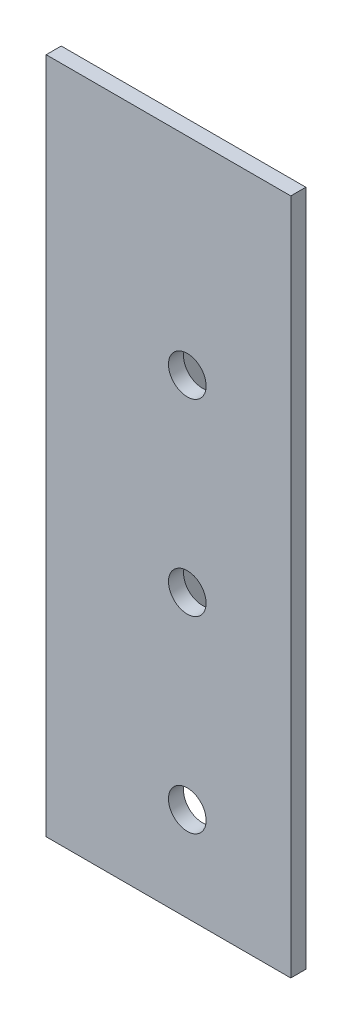
ISO-10303-21;
HEADER;
FILE_DESCRIPTION(('STEP AP214'),'2;1');
FILE_NAME('part.step','',(''),(''),'','','');
FILE_SCHEMA(('AUTOMOTIVE_DESIGN { 1 0 10303 214 1 1 1 1 }'));
ENDSEC;
DATA;
#1=APPLICATION_CONTEXT('core data for automotive mechanical design processes');
#2=APPLICATION_PROTOCOL_DEFINITION('international standard','automotive_design',2000,#1);
#3=PRODUCT_CONTEXT('',#1,'mechanical');
#4=PRODUCT('Part','Part','',(#3));
#5=PRODUCT_RELATED_PRODUCT_CATEGORY('part','',(#4));
#6=PRODUCT_DEFINITION_FORMATION('','',#4);
#7=PRODUCT_DEFINITION_CONTEXT('part definition',#1,'design');
#8=PRODUCT_DEFINITION('design','',#6,#7);
#9=PRODUCT_DEFINITION_SHAPE('','',#8);
#10=(LENGTH_UNIT() NAMED_UNIT(*) SI_UNIT(.MILLI.,.METRE.));
#11=(NAMED_UNIT(*) PLANE_ANGLE_UNIT() SI_UNIT($,.RADIAN.));
#12=(NAMED_UNIT(*) SI_UNIT($,.STERADIAN.) SOLID_ANGLE_UNIT());
#13=UNCERTAINTY_MEASURE_WITH_UNIT(LENGTH_MEASURE(1.E-05),#10,'distance_accuracy_value','');
#14=(GEOMETRIC_REPRESENTATION_CONTEXT(3) GLOBAL_UNCERTAINTY_ASSIGNED_CONTEXT((#13)) GLOBAL_UNIT_ASSIGNED_CONTEXT((#10,
#11,#12)) REPRESENTATION_CONTEXT('',''));
#15=CARTESIAN_POINT('',(0.,0.,0.));
#16=DIRECTION('',(0.,0.,1.));
#17=DIRECTION('',(1.,0.,0.));
#18=AXIS2_PLACEMENT_3D('',#15,#16,#17);
#19=CARTESIAN_POINT('',(4.,180.,0.));
#20=DIRECTION('',(-1.,0.,0.));
#21=DIRECTION('',(0.,0.,1.));
#22=AXIS2_PLACEMENT_3D('',#19,#20,#21);
#23=PLANE('',#22);
#24=DIRECTION('',(0.,-1.,0.));
#25=VECTOR('',#24,1.);
#26=CARTESIAN_POINT('',(4.,180.,-65.));
#27=LINE('',#26,#25);
#28=CARTESIAN_POINT('',(4.,119.,-65.));
#29=VERTEX_POINT('',#28);
#30=CARTESIAN_POINT('',(4.,0.,-65.));
#31=VERTEX_POINT('',#30);
#32=EDGE_CURVE('E41',#29,#31,#27,.T.);
#33=ORIENTED_EDGE('',*,*,#32,.F.);
#34=DIRECTION('',(0.,0.707106781186548,0.707106781186548));
#35=VECTOR('',#34,1.);
#36=CARTESIAN_POINT('',(4.,182.,-2.));
#37=LINE('',#36,#35);
#38=CARTESIAN_POINT('',(4.,180.,-4.));
#39=VERTEX_POINT('',#38);
#40=EDGE_CURVE('E101',#29,#39,#37,.T.);
#41=ORIENTED_EDGE('',*,*,#40,.T.);
#42=DIRECTION('',(0.,-1.,0.));
#43=VECTOR('',#42,1.);
#44=CARTESIAN_POINT('',(4.,180.,-4.));
#45=LINE('',#44,#43);
#46=CARTESIAN_POINT('',(4.,0.,-4.));
#47=VERTEX_POINT('',#46);
#48=EDGE_CURVE('E149',#39,#47,#45,.T.);
#49=ORIENTED_EDGE('',*,*,#48,.T.);
#50=DIRECTION('',(0.,0.,-1.));
#51=VECTOR('',#50,1.);
#52=CARTESIAN_POINT('',(4.,0.,0.));
#53=LINE('',#52,#51);
#54=EDGE_CURVE('E124',#47,#31,#53,.T.);
#55=ORIENTED_EDGE('',*,*,#54,.T.);
#56=EDGE_LOOP('',(#33,#41,#49,#55));
#57=FACE_BOUND('',#56,.T.);
#58=ADVANCED_FACE('F34',(#57),#23,.F.);
#59=CARTESIAN_POINT('',(0.,180.,-65.));
#60=DIRECTION('',(0.,0.,-1.));
#61=DIRECTION('',(-1.,0.,0.));
#62=AXIS2_PLACEMENT_3D('',#59,#60,#61);
#63=PLANE('',#62);
#64=DIRECTION('',(-1.,0.,0.));
#65=VECTOR('',#64,1.);
#66=CARTESIAN_POINT('',(10.,119.,-65.));
#67=LINE('',#66,#65);
#68=CARTESIAN_POINT('',(0.,119.,-65.));
#69=VERTEX_POINT('',#68);
#70=EDGE_CURVE('E98',#29,#69,#67,.T.);
#71=ORIENTED_EDGE('',*,*,#70,.F.);
#72=ORIENTED_EDGE('',*,*,#32,.T.);
#73=DIRECTION('',(1.,0.,0.));
#74=VECTOR('',#73,1.);
#75=CARTESIAN_POINT('',(0.,0.,-65.));
#76=LINE('',#75,#74);
#77=CARTESIAN_POINT('',(0.,0.,-65.));
#78=VERTEX_POINT('',#77);
#79=EDGE_CURVE('E113',#78,#31,#76,.T.);
#80=ORIENTED_EDGE('',*,*,#79,.F.);
#81=DIRECTION('',(0.,-1.,0.));
#82=VECTOR('',#81,1.);
#83=CARTESIAN_POINT('',(0.,180.,-65.));
#84=LINE('',#83,#82);
#85=EDGE_CURVE('E107',#69,#78,#84,.T.);
#86=ORIENTED_EDGE('',*,*,#85,.F.);
#87=EDGE_LOOP('',(#71,#72,#80,#86));
#88=FACE_BOUND('',#87,.T.);
#89=ADVANCED_FACE('F111',(#88),#63,.T.);
#90=CARTESIAN_POINT('',(0.,180.,0.));
#91=DIRECTION('',(-1.,0.,0.));
#92=DIRECTION('',(0.,0.,1.));
#93=AXIS2_PLACEMENT_3D('',#90,#91,#92);
#94=PLANE('',#93);
#95=DIRECTION('',(0.,0.707106781186548,0.707106781186548));
#96=VECTOR('',#95,1.);
#97=CARTESIAN_POINT('',(0.,180.,-4.));
#98=LINE('',#97,#96);
#99=CARTESIAN_POINT('',(0.,180.,-4.));
#100=VERTEX_POINT('',#99);
#101=EDGE_CURVE('E48',#69,#100,#98,.T.);
#102=ORIENTED_EDGE('',*,*,#101,.F.);
#103=ORIENTED_EDGE('',*,*,#85,.T.);
#104=DIRECTION('',(0.,0.,-1.));
#105=VECTOR('',#104,1.);
#106=CARTESIAN_POINT('',(0.,0.,0.));
#107=LINE('',#106,#105);
#108=CARTESIAN_POINT('',(0.,0.,0.));
#109=VERTEX_POINT('',#108);
#110=EDGE_CURVE('E153',#109,#78,#107,.T.);
#111=ORIENTED_EDGE('',*,*,#110,.F.);
#112=DIRECTION('',(0.,-1.,0.));
#113=VECTOR('',#112,1.);
#114=CARTESIAN_POINT('',(0.,180.,0.));
#115=LINE('',#114,#113);
#116=CARTESIAN_POINT('',(0.,180.,0.));
#117=VERTEX_POINT('',#116);
#118=EDGE_CURVE('E88',#117,#109,#115,.T.);
#119=ORIENTED_EDGE('',*,*,#118,.F.);
#120=DIRECTION('',(0.,0.,-1.));
#121=VECTOR('',#120,1.);
#122=CARTESIAN_POINT('',(0.,180.,0.));
#123=LINE('',#122,#121);
#124=EDGE_CURVE('E109',#117,#100,#123,.T.);
#125=ORIENTED_EDGE('',*,*,#124,.T.);
#126=EDGE_LOOP('',(#102,#103,#111,#119,#125));
#127=FACE_BOUND('',#126,.T.);
#128=ADVANCED_FACE('F106',(#127),#94,.T.);
#129=CARTESIAN_POINT('',(0.,180.,0.));
#130=DIRECTION('',(0.,0.,1.));
#131=DIRECTION('',(1.,0.,0.));
#132=AXIS2_PLACEMENT_3D('',#129,#130,#131);
#133=PLANE('',#132);
#134=CARTESIAN_POINT('',(37.5000000000002,75.,0.));
#135=DIRECTION('',(0.,0.,-1.));
#136=DIRECTION('',(-1.,0.,0.));
#137=AXIS2_PLACEMENT_3D('',#134,#135,#136);
#138=CIRCLE('',#137,5.);
#139=CARTESIAN_POINT('',(32.5000000000002,75.,0.));
#140=VERTEX_POINT('',#139);
#141=EDGE_CURVE('E129',#140,#140,#138,.T.);
#142=ORIENTED_EDGE('',*,*,#141,.T.);
#143=EDGE_LOOP('',(#142));
#144=FACE_BOUND('',#143,.T.);
#145=CARTESIAN_POINT('',(37.5000000000003,125.,0.));
#146=DIRECTION('',(0.,0.,-1.));
#147=DIRECTION('',(-1.,0.,0.));
#148=AXIS2_PLACEMENT_3D('',#145,#146,#147);
#149=CIRCLE('',#148,5.00000000000001);
#150=CARTESIAN_POINT('',(32.5000000000003,125.,0.));
#151=VERTEX_POINT('',#150);
#152=EDGE_CURVE('E139',#151,#151,#149,.T.);
#153=ORIENTED_EDGE('',*,*,#152,.T.);
#154=EDGE_LOOP('',(#153));
#155=FACE_BOUND('',#154,.T.);
#156=CARTESIAN_POINT('',(37.5,25.,0.));
#157=DIRECTION('',(0.,0.,-1.));
#158=DIRECTION('',(-1.,0.,0.));
#159=AXIS2_PLACEMENT_3D('',#156,#157,#158);
#160=CIRCLE('',#159,5.);
#161=CARTESIAN_POINT('',(32.5,25.,0.));
#162=VERTEX_POINT('',#161);
#163=EDGE_CURVE('E125',#162,#162,#160,.T.);
#164=ORIENTED_EDGE('',*,*,#163,.T.);
#165=EDGE_LOOP('',(#164));
#166=FACE_BOUND('',#165,.T.);
#167=DIRECTION('',(-1.,0.,0.));
#168=VECTOR('',#167,1.);
#169=CARTESIAN_POINT('',(0.,0.,0.));
#170=LINE('',#169,#168);
#171=CARTESIAN_POINT('',(65.,0.,0.));
#172=VERTEX_POINT('',#171);
#173=EDGE_CURVE('E155',#172,#109,#170,.T.);
#174=ORIENTED_EDGE('',*,*,#173,.F.);
#175=DIRECTION('',(0.,-1.,0.));
#176=VECTOR('',#175,1.);
#177=CARTESIAN_POINT('',(65.,180.,0.));
#178=LINE('',#177,#176);
#179=CARTESIAN_POINT('',(65.,180.,0.));
#180=VERTEX_POINT('',#179);
#181=EDGE_CURVE('E117',#180,#172,#178,.T.);
#182=ORIENTED_EDGE('',*,*,#181,.F.);
#183=DIRECTION('',(-1.,0.,0.));
#184=VECTOR('',#183,1.);
#185=CARTESIAN_POINT('',(0.,180.,0.));
#186=LINE('',#185,#184);
#187=EDGE_CURVE('E142',#180,#117,#186,.T.);
#188=ORIENTED_EDGE('',*,*,#187,.T.);
#189=ORIENTED_EDGE('',*,*,#118,.T.);
#190=EDGE_LOOP('',(#174,#182,#188,#189));
#191=FACE_BOUND('',#190,.T.);
#192=ADVANCED_FACE('F168',(#144,#155,#166,#191),#133,.T.);
#193=CARTESIAN_POINT('',(65.,180.,-4.));
#194=DIRECTION('',(1.,0.,0.));
#195=DIRECTION('',(0.,0.,-1.));
#196=AXIS2_PLACEMENT_3D('',#193,#194,#195);
#197=PLANE('',#196);
#198=DIRECTION('',(0.,0.,1.));
#199=VECTOR('',#198,1.);
#200=CARTESIAN_POINT('',(65.,0.,-4.));
#201=LINE('',#200,#199);
#202=CARTESIAN_POINT('',(65.,0.,-4.));
#203=VERTEX_POINT('',#202);
#204=EDGE_CURVE('E158',#203,#172,#201,.T.);
#205=ORIENTED_EDGE('',*,*,#204,.F.);
#206=DIRECTION('',(0.,-1.,0.));
#207=VECTOR('',#206,1.);
#208=CARTESIAN_POINT('',(65.,180.,-4.));
#209=LINE('',#208,#207);
#210=CARTESIAN_POINT('',(65.,180.,-4.));
#211=VERTEX_POINT('',#210);
#212=EDGE_CURVE('E56',#211,#203,#209,.T.);
#213=ORIENTED_EDGE('',*,*,#212,.F.);
#214=DIRECTION('',(0.,0.,1.));
#215=VECTOR('',#214,1.);
#216=CARTESIAN_POINT('',(65.,180.,-4.));
#217=LINE('',#216,#215);
#218=EDGE_CURVE('E145',#211,#180,#217,.T.);
#219=ORIENTED_EDGE('',*,*,#218,.T.);
#220=ORIENTED_EDGE('',*,*,#181,.T.);
#221=EDGE_LOOP('',(#205,#213,#219,#220));
#222=FACE_BOUND('',#221,.T.);
#223=ADVANCED_FACE('F164',(#222),#197,.T.);
#224=CARTESIAN_POINT('',(0.,180.,-4.));
#225=DIRECTION('',(0.,0.,1.));
#226=DIRECTION('',(1.,0.,0.));
#227=AXIS2_PLACEMENT_3D('',#224,#225,#226);
#228=PLANE('',#227);
#229=CARTESIAN_POINT('',(37.5000000000002,75.,-4.));
#230=DIRECTION('',(0.,0.,1.));
#231=DIRECTION('',(1.,0.,0.));
#232=AXIS2_PLACEMENT_3D('',#229,#230,#231);
#233=CIRCLE('',#232,5.);
#234=CARTESIAN_POINT('',(42.5000000000002,75.,-4.));
#235=VERTEX_POINT('',#234);
#236=EDGE_CURVE('E128',#235,#235,#233,.F.);
#237=ORIENTED_EDGE('',*,*,#236,.F.);
#238=EDGE_LOOP('',(#237));
#239=FACE_BOUND('',#238,.T.);
#240=CARTESIAN_POINT('',(37.5000000000003,125.,-4.));
#241=DIRECTION('',(0.,0.,1.));
#242=DIRECTION('',(1.,0.,0.));
#243=AXIS2_PLACEMENT_3D('',#240,#241,#242);
#244=CIRCLE('',#243,5.00000000000001);
#245=CARTESIAN_POINT('',(42.5000000000003,125.,-4.));
#246=VERTEX_POINT('',#245);
#247=EDGE_CURVE('E126',#246,#246,#244,.F.);
#248=ORIENTED_EDGE('',*,*,#247,.F.);
#249=EDGE_LOOP('',(#248));
#250=FACE_BOUND('',#249,.T.);
#251=CARTESIAN_POINT('',(37.5,25.,-4.));
#252=DIRECTION('',(0.,0.,1.));
#253=DIRECTION('',(1.,0.,0.));
#254=AXIS2_PLACEMENT_3D('',#251,#252,#253);
#255=CIRCLE('',#254,5.);
#256=CARTESIAN_POINT('',(42.5,25.,-4.));
#257=VERTEX_POINT('',#256);
#258=EDGE_CURVE('E121',#257,#257,#255,.F.);
#259=ORIENTED_EDGE('',*,*,#258,.F.);
#260=EDGE_LOOP('',(#259));
#261=FACE_BOUND('',#260,.T.);
#262=DIRECTION('',(1.,0.,0.));
#263=VECTOR('',#262,1.);
#264=CARTESIAN_POINT('',(0.,0.,-4.));
#265=LINE('',#264,#263);
#266=EDGE_CURVE('E82',#203,#47,#265,.F.);
#267=ORIENTED_EDGE('',*,*,#266,.T.);
#268=ORIENTED_EDGE('',*,*,#48,.F.);
#269=DIRECTION('',(1.,0.,0.));
#270=VECTOR('',#269,1.);
#271=CARTESIAN_POINT('',(0.,180.,-4.));
#272=LINE('',#271,#270);
#273=EDGE_CURVE('E147',#211,#39,#272,.F.);
#274=ORIENTED_EDGE('',*,*,#273,.F.);
#275=ORIENTED_EDGE('',*,*,#212,.T.);
#276=EDGE_LOOP('',(#267,#268,#274,#275));
#277=FACE_BOUND('',#276,.T.);
#278=ADVANCED_FACE('F173',(#239,#250,#261,#277),#228,.F.);
#279=CARTESIAN_POINT('',(0.,180.,0.));
#280=DIRECTION('',(0.,-1.,0.));
#281=DIRECTION('',(-1.,0.,0.));
#282=AXIS2_PLACEMENT_3D('',#279,#280,#281);
#283=PLANE('',#282);
#284=ORIENTED_EDGE('',*,*,#273,.T.);
#285=DIRECTION('',(-1.,0.,0.));
#286=VECTOR('',#285,1.);
#287=CARTESIAN_POINT('',(0.,180.,-4.));
#288=LINE('',#287,#286);
#289=EDGE_CURVE('E11',#39,#100,#288,.T.);
#290=ORIENTED_EDGE('',*,*,#289,.T.);
#291=ORIENTED_EDGE('',*,*,#124,.F.);
#292=ORIENTED_EDGE('',*,*,#187,.F.);
#293=ORIENTED_EDGE('',*,*,#218,.F.);
#294=EDGE_LOOP('',(#284,#290,#291,#292,#293));
#295=FACE_BOUND('',#294,.T.);
#296=ADVANCED_FACE('F175',(#295),#283,.F.);
#297=CARTESIAN_POINT('',(0.,0.,0.));
#298=DIRECTION('',(0.,-1.,0.));
#299=DIRECTION('',(-1.,0.,0.));
#300=AXIS2_PLACEMENT_3D('',#297,#298,#299);
#301=PLANE('',#300);
#302=ORIENTED_EDGE('',*,*,#54,.F.);
#303=ORIENTED_EDGE('',*,*,#266,.F.);
#304=ORIENTED_EDGE('',*,*,#204,.T.);
#305=ORIENTED_EDGE('',*,*,#173,.T.);
#306=ORIENTED_EDGE('',*,*,#110,.T.);
#307=ORIENTED_EDGE('',*,*,#79,.T.);
#308=EDGE_LOOP('',(#302,#303,#304,#305,#306,#307));
#309=FACE_BOUND('',#308,.T.);
#310=ADVANCED_FACE('F171',(#309),#301,.T.);
#311=CARTESIAN_POINT('',(37.5,25.,-10.));
#312=DIRECTION('',(0.,0.,1.));
#313=DIRECTION('',(1.,0.,0.));
#314=AXIS2_PLACEMENT_3D('',#311,#312,#313);
#315=CYLINDRICAL_SURFACE('',#314,5.);
#316=ORIENTED_EDGE('',*,*,#163,.F.);
#317=EDGE_LOOP('',(#316));
#318=FACE_BOUND('',#317,.T.);
#319=ORIENTED_EDGE('',*,*,#258,.T.);
#320=EDGE_LOOP('',(#319));
#321=FACE_BOUND('',#320,.T.);
#322=ADVANCED_FACE('F182',(#318,#321),#315,.F.);
#323=CARTESIAN_POINT('',(37.5000000000003,125.,-10.));
#324=DIRECTION('',(0.,0.,1.));
#325=DIRECTION('',(1.,0.,0.));
#326=AXIS2_PLACEMENT_3D('',#323,#324,#325);
#327=CYLINDRICAL_SURFACE('',#326,5.00000000000001);
#328=ORIENTED_EDGE('',*,*,#152,.F.);
#329=EDGE_LOOP('',(#328));
#330=FACE_BOUND('',#329,.T.);
#331=ORIENTED_EDGE('',*,*,#247,.T.);
#332=EDGE_LOOP('',(#331));
#333=FACE_BOUND('',#332,.T.);
#334=ADVANCED_FACE('F235',(#330,#333),#327,.F.);
#335=CARTESIAN_POINT('',(37.5000000000002,75.,-10.));
#336=DIRECTION('',(0.,0.,1.));
#337=DIRECTION('',(1.,0.,0.));
#338=AXIS2_PLACEMENT_3D('',#335,#336,#337);
#339=CYLINDRICAL_SURFACE('',#338,5.);
#340=ORIENTED_EDGE('',*,*,#141,.F.);
#341=EDGE_LOOP('',(#340));
#342=FACE_BOUND('',#341,.T.);
#343=ORIENTED_EDGE('',*,*,#236,.T.);
#344=EDGE_LOOP('',(#343));
#345=FACE_BOUND('',#344,.T.);
#346=ADVANCED_FACE('F225',(#342,#345),#339,.F.);
#347=CARTESIAN_POINT('',(10.,180.,-4.));
#348=DIRECTION('',(0.,-0.707106781186548,0.707106781186548));
#349=DIRECTION('',(0.,-0.707106781186548,-0.707106781186548));
#350=AXIS2_PLACEMENT_3D('',#347,#348,#349);
#351=PLANE('',#350);
#352=ORIENTED_EDGE('',*,*,#70,.T.);
#353=ORIENTED_EDGE('',*,*,#101,.T.);
#354=ORIENTED_EDGE('',*,*,#289,.F.);
#355=ORIENTED_EDGE('',*,*,#40,.F.);
#356=EDGE_LOOP('',(#352,#353,#354,#355));
#357=FACE_BOUND('',#356,.T.);
#358=ADVANCED_FACE('F99',(#357),#351,.F.);
#359=CLOSED_SHELL('',(#58,#89,#128,#192,#223,#278,#296,#310,#322,#334,#346,#358));
#360=MANIFOLD_SOLID_BREP('B2',#359);
#361=ADVANCED_BREP_SHAPE_REPRESENTATION('',(#18,#360),#14);
#362=SHAPE_DEFINITION_REPRESENTATION(#9,#361);
ENDSEC;
END-ISO-10303-21;
